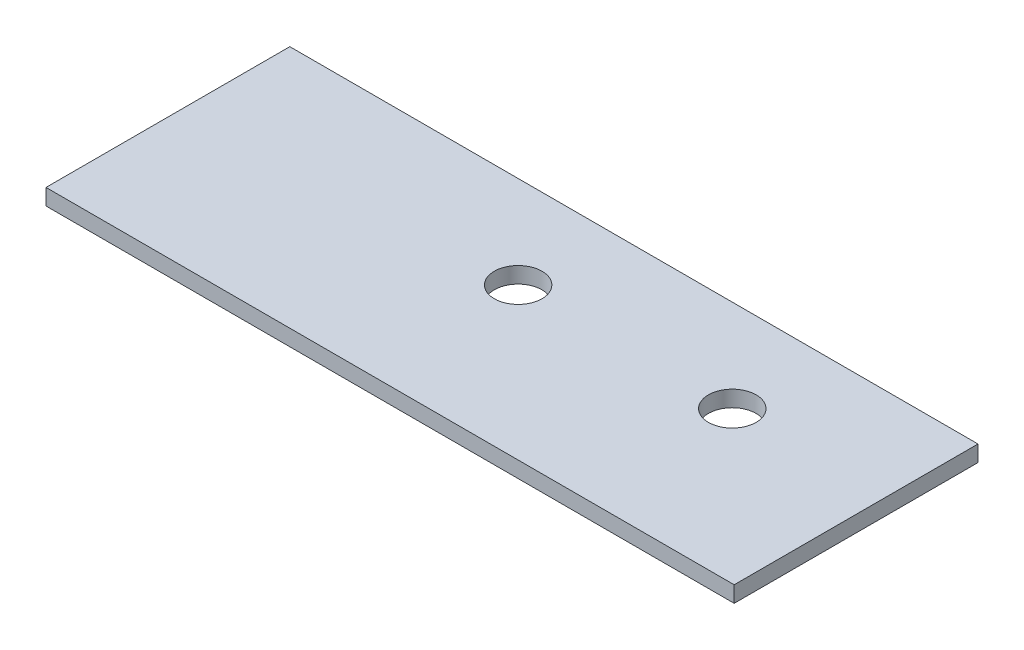
ISO-10303-21;
HEADER;
FILE_DESCRIPTION(('STEP AP214'),'2;1');
FILE_NAME('part.step','',(''),(''),'','','');
FILE_SCHEMA(('AUTOMOTIVE_DESIGN { 1 0 10303 214 1 1 1 1 }'));
ENDSEC;
DATA;
#1=APPLICATION_CONTEXT('core data for automotive mechanical design processes');
#2=APPLICATION_PROTOCOL_DEFINITION('international standard','automotive_design',2000,#1);
#3=PRODUCT_CONTEXT('',#1,'mechanical');
#4=PRODUCT('Part','Part','',(#3));
#5=PRODUCT_RELATED_PRODUCT_CATEGORY('part','',(#4));
#6=PRODUCT_DEFINITION_FORMATION('','',#4);
#7=PRODUCT_DEFINITION_CONTEXT('part definition',#1,'design');
#8=PRODUCT_DEFINITION('design','',#6,#7);
#9=PRODUCT_DEFINITION_SHAPE('','',#8);
#10=(LENGTH_UNIT() NAMED_UNIT(*) SI_UNIT(.MILLI.,.METRE.));
#11=(NAMED_UNIT(*) PLANE_ANGLE_UNIT() SI_UNIT($,.RADIAN.));
#12=(NAMED_UNIT(*) SI_UNIT($,.STERADIAN.) SOLID_ANGLE_UNIT());
#13=UNCERTAINTY_MEASURE_WITH_UNIT(LENGTH_MEASURE(1.E-05),#10,'distance_accuracy_value','');
#14=(GEOMETRIC_REPRESENTATION_CONTEXT(3) GLOBAL_UNCERTAINTY_ASSIGNED_CONTEXT((#13)) GLOBAL_UNIT_ASSIGNED_CONTEXT((#10,
#11,#12)) REPRESENTATION_CONTEXT('',''));
#15=CARTESIAN_POINT('',(0.,0.,0.));
#16=DIRECTION('',(0.,0.,1.));
#17=DIRECTION('',(1.,0.,0.));
#18=AXIS2_PLACEMENT_3D('',#15,#16,#17);
#19=CARTESIAN_POINT('',(16.23,0.38,5.75));
#20=DIRECTION('',(0.,1.,0.));
#21=DIRECTION('',(0.,0.,1.));
#22=AXIS2_PLACEMENT_3D('',#19,#20,#21);
#23=PLANE('',#22);
#24=CARTESIAN_POINT('',(-1.11,0.38,-1.4));
#25=DIRECTION('',(0.,1.,0.));
#26=DIRECTION('',(0.,0.,1.));
#27=AXIS2_PLACEMENT_3D('',#24,#25,#26);
#28=CIRCLE('',#27,1.125);
#29=CARTESIAN_POINT('',(-1.11,0.38,-0.274999999999999));
#30=VERTEX_POINT('',#29);
#31=EDGE_CURVE('E100',#30,#30,#28,.T.);
#32=ORIENTED_EDGE('',*,*,#31,.F.);
#33=EDGE_LOOP('',(#32));
#34=FACE_BOUND('',#33,.T.);
#35=DIRECTION('',(0.,0.,-1.));
#36=VECTOR('',#35,1.);
#37=CARTESIAN_POINT('',(16.23,0.38,-5.75));
#38=LINE('',#37,#36);
#39=CARTESIAN_POINT('',(16.23,0.38,5.75));
#40=VERTEX_POINT('',#39);
#41=CARTESIAN_POINT('',(16.23,0.38,-5.75));
#42=VERTEX_POINT('',#41);
#43=EDGE_CURVE('E85',#40,#42,#38,.T.);
#44=ORIENTED_EDGE('',*,*,#43,.T.);
#45=DIRECTION('',(-1.,0.,0.));
#46=VECTOR('',#45,1.);
#47=CARTESIAN_POINT('',(-16.23,0.38,-5.75));
#48=LINE('',#47,#46);
#49=CARTESIAN_POINT('',(-16.23,0.38,-5.75));
#50=VERTEX_POINT('',#49);
#51=EDGE_CURVE('E80',#42,#50,#48,.T.);
#52=ORIENTED_EDGE('',*,*,#51,.T.);
#53=DIRECTION('',(0.,0.,1.));
#54=VECTOR('',#53,1.);
#55=CARTESIAN_POINT('',(-16.23,0.38,-5.75));
#56=LINE('',#55,#54);
#57=CARTESIAN_POINT('',(-16.23,0.38,5.75));
#58=VERTEX_POINT('',#57);
#59=EDGE_CURVE('E83',#50,#58,#56,.T.);
#60=ORIENTED_EDGE('',*,*,#59,.T.);
#61=DIRECTION('',(1.,0.,0.));
#62=VECTOR('',#61,1.);
#63=CARTESIAN_POINT('',(-16.23,0.38,5.75));
#64=LINE('',#63,#62);
#65=EDGE_CURVE('E50',#58,#40,#64,.T.);
#66=ORIENTED_EDGE('',*,*,#65,.T.);
#67=EDGE_LOOP('',(#44,#52,#60,#66));
#68=FACE_BOUND('',#67,.T.);
#69=CARTESIAN_POINT('',(8.99,0.38,-1.4));
#70=DIRECTION('',(0.,1.,0.));
#71=DIRECTION('',(0.,0.,1.));
#72=AXIS2_PLACEMENT_3D('',#69,#70,#71);
#73=CIRCLE('',#72,1.125);
#74=CARTESIAN_POINT('',(8.99,0.38,-0.274999999999999));
#75=VERTEX_POINT('',#74);
#76=EDGE_CURVE('E115',#75,#75,#73,.T.);
#77=ORIENTED_EDGE('',*,*,#76,.F.);
#78=EDGE_LOOP('',(#77));
#79=FACE_BOUND('',#78,.T.);
#80=ADVANCED_FACE('F33',(#34,#68,#79),#23,.T.);
#81=CARTESIAN_POINT('',(16.23,-0.38,5.75));
#82=DIRECTION('',(0.,1.,0.));
#83=DIRECTION('',(0.,0.,1.));
#84=AXIS2_PLACEMENT_3D('',#81,#82,#83);
#85=PLANE('',#84);
#86=CARTESIAN_POINT('',(-1.11,-0.38,-1.4));
#87=DIRECTION('',(0.,1.,0.));
#88=DIRECTION('',(0.,0.,1.));
#89=AXIS2_PLACEMENT_3D('',#86,#87,#88);
#90=CIRCLE('',#89,1.125);
#91=CARTESIAN_POINT('',(-1.11,-0.38,-0.274999999999999));
#92=VERTEX_POINT('',#91);
#93=EDGE_CURVE('E112',#92,#92,#90,.T.);
#94=ORIENTED_EDGE('',*,*,#93,.T.);
#95=EDGE_LOOP('',(#94));
#96=FACE_BOUND('',#95,.T.);
#97=DIRECTION('',(0.,0.,-1.));
#98=VECTOR('',#97,1.);
#99=CARTESIAN_POINT('',(16.23,-0.38,-5.75));
#100=LINE('',#99,#98);
#101=CARTESIAN_POINT('',(16.23,-0.38,5.75));
#102=VERTEX_POINT('',#101);
#103=CARTESIAN_POINT('',(16.23,-0.38,-5.75));
#104=VERTEX_POINT('',#103);
#105=EDGE_CURVE('E97',#102,#104,#100,.T.);
#106=ORIENTED_EDGE('',*,*,#105,.F.);
#107=DIRECTION('',(1.,0.,0.));
#108=VECTOR('',#107,1.);
#109=CARTESIAN_POINT('',(-16.23,-0.38,5.75));
#110=LINE('',#109,#108);
#111=CARTESIAN_POINT('',(-16.23,-0.38,5.75));
#112=VERTEX_POINT('',#111);
#113=EDGE_CURVE('E73',#112,#102,#110,.T.);
#114=ORIENTED_EDGE('',*,*,#113,.F.);
#115=DIRECTION('',(0.,0.,1.));
#116=VECTOR('',#115,1.);
#117=CARTESIAN_POINT('',(-16.23,-0.38,-5.75));
#118=LINE('',#117,#116);
#119=CARTESIAN_POINT('',(-16.23,-0.38,-5.75));
#120=VERTEX_POINT('',#119);
#121=EDGE_CURVE('E67',#120,#112,#118,.T.);
#122=ORIENTED_EDGE('',*,*,#121,.F.);
#123=DIRECTION('',(-1.,0.,0.));
#124=VECTOR('',#123,1.);
#125=CARTESIAN_POINT('',(-16.23,-0.38,-5.75));
#126=LINE('',#125,#124);
#127=EDGE_CURVE('E89',#104,#120,#126,.T.);
#128=ORIENTED_EDGE('',*,*,#127,.F.);
#129=EDGE_LOOP('',(#106,#114,#122,#128));
#130=FACE_BOUND('',#129,.T.);
#131=CARTESIAN_POINT('',(8.99,-0.38,-1.4));
#132=DIRECTION('',(0.,1.,0.));
#133=DIRECTION('',(0.,0.,1.));
#134=AXIS2_PLACEMENT_3D('',#131,#132,#133);
#135=CIRCLE('',#134,1.125);
#136=CARTESIAN_POINT('',(8.99,-0.38,-0.274999999999999));
#137=VERTEX_POINT('',#136);
#138=EDGE_CURVE('E118',#137,#137,#135,.T.);
#139=ORIENTED_EDGE('',*,*,#138,.T.);
#140=EDGE_LOOP('',(#139));
#141=FACE_BOUND('',#140,.T.);
#142=ADVANCED_FACE('F108',(#96,#130,#141),#85,.F.);
#143=CARTESIAN_POINT('',(16.23,0.38,-5.75));
#144=DIRECTION('',(-1.,0.,0.));
#145=DIRECTION('',(0.,0.,1.));
#146=AXIS2_PLACEMENT_3D('',#143,#144,#145);
#147=PLANE('',#146);
#148=ORIENTED_EDGE('',*,*,#105,.T.);
#149=DIRECTION('',(0.,-1.,0.));
#150=VECTOR('',#149,1.);
#151=CARTESIAN_POINT('',(16.23,0.38,-5.75));
#152=LINE('',#151,#150);
#153=EDGE_CURVE('E11',#42,#104,#152,.T.);
#154=ORIENTED_EDGE('',*,*,#153,.F.);
#155=ORIENTED_EDGE('',*,*,#43,.F.);
#156=DIRECTION('',(0.,-1.,0.));
#157=VECTOR('',#156,1.);
#158=CARTESIAN_POINT('',(16.23,0.38,5.75));
#159=LINE('',#158,#157);
#160=EDGE_CURVE('E93',#40,#102,#159,.T.);
#161=ORIENTED_EDGE('',*,*,#160,.T.);
#162=EDGE_LOOP('',(#148,#154,#155,#161));
#163=FACE_BOUND('',#162,.T.);
#164=ADVANCED_FACE('F35',(#163),#147,.F.);
#165=CARTESIAN_POINT('',(-16.23,0.38,-5.75));
#166=DIRECTION('',(0.,0.,1.));
#167=DIRECTION('',(1.,0.,0.));
#168=AXIS2_PLACEMENT_3D('',#165,#166,#167);
#169=PLANE('',#168);
#170=ORIENTED_EDGE('',*,*,#127,.T.);
#171=DIRECTION('',(0.,-1.,0.));
#172=VECTOR('',#171,1.);
#173=CARTESIAN_POINT('',(-16.23,0.38,-5.75));
#174=LINE('',#173,#172);
#175=EDGE_CURVE('E42',#50,#120,#174,.T.);
#176=ORIENTED_EDGE('',*,*,#175,.F.);
#177=ORIENTED_EDGE('',*,*,#51,.F.);
#178=ORIENTED_EDGE('',*,*,#153,.T.);
#179=EDGE_LOOP('',(#170,#176,#177,#178));
#180=FACE_BOUND('',#179,.T.);
#181=ADVANCED_FACE('F88',(#180),#169,.F.);
#182=CARTESIAN_POINT('',(-16.23,0.38,-5.75));
#183=DIRECTION('',(1.,0.,0.));
#184=DIRECTION('',(0.,0.,-1.));
#185=AXIS2_PLACEMENT_3D('',#182,#183,#184);
#186=PLANE('',#185);
#187=ORIENTED_EDGE('',*,*,#121,.T.);
#188=DIRECTION('',(0.,-1.,0.));
#189=VECTOR('',#188,1.);
#190=CARTESIAN_POINT('',(-16.23,0.38,5.75));
#191=LINE('',#190,#189);
#192=EDGE_CURVE('E90',#58,#112,#191,.T.);
#193=ORIENTED_EDGE('',*,*,#192,.F.);
#194=ORIENTED_EDGE('',*,*,#59,.F.);
#195=ORIENTED_EDGE('',*,*,#175,.T.);
#196=EDGE_LOOP('',(#187,#193,#194,#195));
#197=FACE_BOUND('',#196,.T.);
#198=ADVANCED_FACE('F91',(#197),#186,.F.);
#199=CARTESIAN_POINT('',(-16.23,0.38,5.75));
#200=DIRECTION('',(0.,0.,-1.));
#201=DIRECTION('',(-1.,0.,0.));
#202=AXIS2_PLACEMENT_3D('',#199,#200,#201);
#203=PLANE('',#202);
#204=ORIENTED_EDGE('',*,*,#113,.T.);
#205=ORIENTED_EDGE('',*,*,#160,.F.);
#206=ORIENTED_EDGE('',*,*,#65,.F.);
#207=ORIENTED_EDGE('',*,*,#192,.T.);
#208=EDGE_LOOP('',(#204,#205,#206,#207));
#209=FACE_BOUND('',#208,.T.);
#210=ADVANCED_FACE('F105',(#209),#203,.F.);
#211=CARTESIAN_POINT('',(-1.11,0.38,-1.4));
#212=DIRECTION('',(0.,-1.,0.));
#213=DIRECTION('',(0.,0.,-1.));
#214=AXIS2_PLACEMENT_3D('',#211,#212,#213);
#215=CYLINDRICAL_SURFACE('',#214,1.125);
#216=ORIENTED_EDGE('',*,*,#31,.T.);
#217=EDGE_LOOP('',(#216));
#218=FACE_BOUND('',#217,.T.);
#219=ORIENTED_EDGE('',*,*,#93,.F.);
#220=EDGE_LOOP('',(#219));
#221=FACE_BOUND('',#220,.T.);
#222=ADVANCED_FACE('F136',(#218,#221),#215,.F.);
#223=CARTESIAN_POINT('',(8.99,0.38,-1.4));
#224=DIRECTION('',(0.,-1.,0.));
#225=DIRECTION('',(0.,0.,-1.));
#226=AXIS2_PLACEMENT_3D('',#223,#224,#225);
#227=CYLINDRICAL_SURFACE('',#226,1.125);
#228=ORIENTED_EDGE('',*,*,#76,.T.);
#229=EDGE_LOOP('',(#228));
#230=FACE_BOUND('',#229,.T.);
#231=ORIENTED_EDGE('',*,*,#138,.F.);
#232=EDGE_LOOP('',(#231));
#233=FACE_BOUND('',#232,.T.);
#234=ADVANCED_FACE('F124',(#230,#233),#227,.F.);
#235=CLOSED_SHELL('',(#80,#142,#164,#181,#198,#210,#222,#234));
#236=MANIFOLD_SOLID_BREP('B2',#235);
#237=ADVANCED_BREP_SHAPE_REPRESENTATION('',(#18,#236),#14);
#238=SHAPE_DEFINITION_REPRESENTATION(#9,#237);
ENDSEC;
END-ISO-10303-21;
